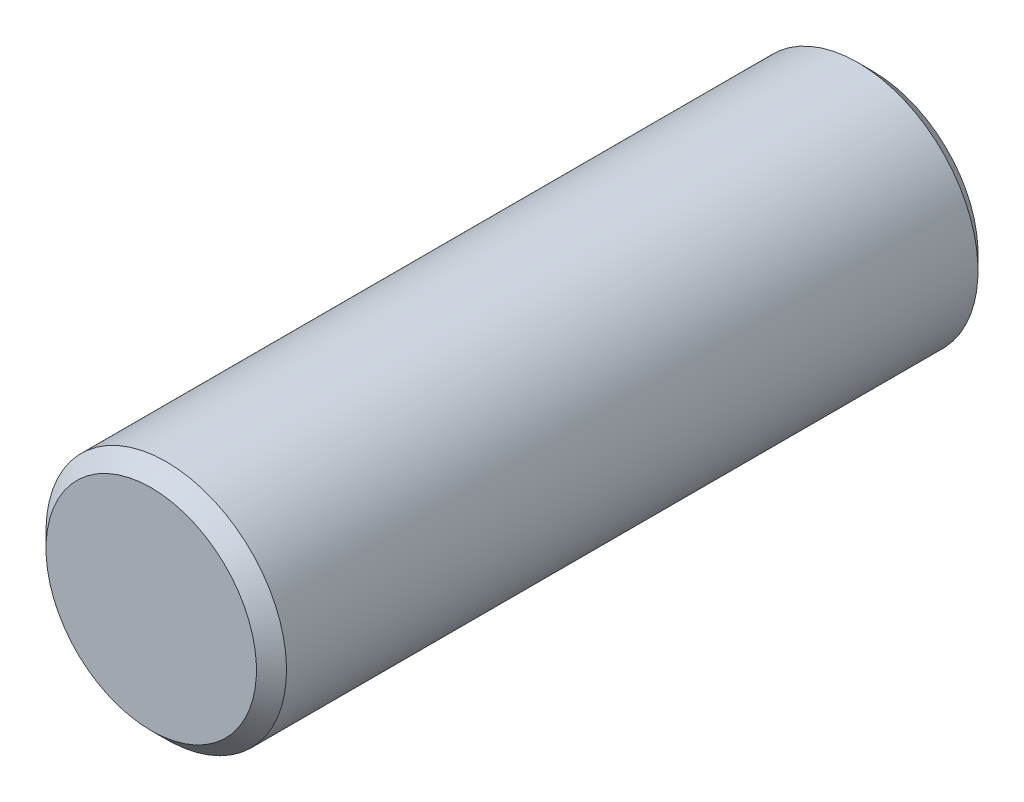
ISO-10303-21;
HEADER;
FILE_DESCRIPTION(('STEP AP214'),'2;1');
FILE_NAME('part.step','',(''),(''),'','','');
FILE_SCHEMA(('AUTOMOTIVE_DESIGN { 1 0 10303 214 1 1 1 1 }'));
ENDSEC;
DATA;
#1=APPLICATION_CONTEXT('core data for automotive mechanical design processes');
#2=APPLICATION_PROTOCOL_DEFINITION('international standard','automotive_design',2000,#1);
#3=PRODUCT_CONTEXT('',#1,'mechanical');
#4=PRODUCT('Part','Part','',(#3));
#5=PRODUCT_RELATED_PRODUCT_CATEGORY('part','',(#4));
#6=PRODUCT_DEFINITION_FORMATION('','',#4);
#7=PRODUCT_DEFINITION_CONTEXT('part definition',#1,'design');
#8=PRODUCT_DEFINITION('design','',#6,#7);
#9=PRODUCT_DEFINITION_SHAPE('','',#8);
#10=(LENGTH_UNIT() NAMED_UNIT(*) SI_UNIT(.MILLI.,.METRE.));
#11=(NAMED_UNIT(*) PLANE_ANGLE_UNIT() SI_UNIT($,.RADIAN.));
#12=(NAMED_UNIT(*) SI_UNIT($,.STERADIAN.) SOLID_ANGLE_UNIT());
#13=UNCERTAINTY_MEASURE_WITH_UNIT(LENGTH_MEASURE(1.E-05),#10,'distance_accuracy_value','');
#14=(GEOMETRIC_REPRESENTATION_CONTEXT(3) GLOBAL_UNCERTAINTY_ASSIGNED_CONTEXT((#13)) GLOBAL_UNIT_ASSIGNED_CONTEXT((#10,
#11,#12)) REPRESENTATION_CONTEXT('',''));
#15=CARTESIAN_POINT('',(0.,0.,0.));
#16=DIRECTION('',(0.,0.,1.));
#17=DIRECTION('',(1.,0.,0.));
#18=AXIS2_PLACEMENT_3D('',#15,#16,#17);
#19=CARTESIAN_POINT('',(0.,0.,5.99999999999999));
#20=DIRECTION('',(0.,0.,1.));
#21=DIRECTION('',(0.,-1.,0.));
#22=AXIS2_PLACEMENT_3D('',#19,#20,#21);
#23=PLANE('',#22);
#24=CARTESIAN_POINT('',(0.,0.,6.00000000002865));
#25=DIRECTION('',(0.,0.,-1.));
#26=DIRECTION('',(0.,1.,0.));
#27=AXIS2_PLACEMENT_3D('',#24,#25,#26);
#28=CIRCLE('',#27,1.74999999995861);
#29=CARTESIAN_POINT('',(0.,1.7499999999586,6.00000000002865));
#30=VERTEX_POINT('',#29);
#31=EDGE_CURVE('E18',#30,#30,#28,.T.);
#32=ORIENTED_EDGE('',*,*,#31,.F.);
#33=EDGE_LOOP('',(#32));
#34=FACE_BOUND('',#33,.T.);
#35=ADVANCED_FACE('F15',(#34),#23,.T.);
#36=CARTESIAN_POINT('',(0.,0.,-5.99999999999998));
#37=DIRECTION('',(0.,0.,1.));
#38=DIRECTION('',(0.,-1.,0.));
#39=AXIS2_PLACEMENT_3D('',#36,#37,#38);
#40=PLANE('',#39);
#41=CARTESIAN_POINT('',(0.,0.,-6.00000000002865));
#42=DIRECTION('',(0.,0.,1.));
#43=DIRECTION('',(0.,-1.,0.));
#44=AXIS2_PLACEMENT_3D('',#41,#42,#43);
#45=CIRCLE('',#44,1.75000000001546);
#46=CARTESIAN_POINT('',(0.,-1.75000000001548,-6.00000000002865));
#47=VERTEX_POINT('',#46);
#48=EDGE_CURVE('E30',#47,#47,#45,.T.);
#49=ORIENTED_EDGE('',*,*,#48,.F.);
#50=EDGE_LOOP('',(#49));
#51=FACE_BOUND('',#50,.T.);
#52=ADVANCED_FACE('F41',(#51),#40,.F.);
#53=CARTESIAN_POINT('',(0.,0.,5.7500000000914));
#54=DIRECTION('',(0.,0.,-1.));
#55=DIRECTION('',(0.,1.,0.));
#56=AXIS2_PLACEMENT_3D('',#53,#54,#55);
#57=CONICAL_SURFACE('',#56,1.99999999989586,0.785398163397448);
#58=CARTESIAN_POINT('',(0.,0.,5.74999999999999));
#59=DIRECTION('',(0.,0.,-1.));
#60=DIRECTION('',(0.,1.,0.));
#61=AXIS2_PLACEMENT_3D('',#58,#59,#60);
#62=CIRCLE('',#61,2.00000000000002);
#63=CARTESIAN_POINT('',(0.,2.,5.74999999999999));
#64=VERTEX_POINT('',#63);
#65=EDGE_CURVE('E23',#64,#64,#62,.T.);
#66=ORIENTED_EDGE('',*,*,#65,.F.);
#67=EDGE_LOOP('',(#66));
#68=FACE_BOUND('',#67,.T.);
#69=ORIENTED_EDGE('',*,*,#31,.T.);
#70=EDGE_LOOP('',(#69));
#71=FACE_BOUND('',#70,.T.);
#72=ADVANCED_FACE('F38',(#68,#71),#57,.T.);
#73=CARTESIAN_POINT('',(0.,0.,-5.7500000000914));
#74=DIRECTION('',(0.,0.,1.));
#75=DIRECTION('',(0.,-1.,0.));
#76=AXIS2_PLACEMENT_3D('',#73,#74,#75);
#77=CONICAL_SURFACE('',#76,1.99999999989586,0.785398163283761);
#78=CARTESIAN_POINT('',(0.,0.,-5.74999999999998));
#79=DIRECTION('',(0.,0.,-1.));
#80=DIRECTION('',(0.,1.,0.));
#81=AXIS2_PLACEMENT_3D('',#78,#79,#80);
#82=CIRCLE('',#81,2.00000000000002);
#83=CARTESIAN_POINT('',(0.,2.,-5.74999999999998));
#84=VERTEX_POINT('',#83);
#85=EDGE_CURVE('E10',#84,#84,#82,.F.);
#86=ORIENTED_EDGE('',*,*,#85,.F.);
#87=EDGE_LOOP('',(#86));
#88=FACE_BOUND('',#87,.T.);
#89=ORIENTED_EDGE('',*,*,#48,.T.);
#90=EDGE_LOOP('',(#89));
#91=FACE_BOUND('',#90,.T.);
#92=ADVANCED_FACE('F49',(#88,#91),#77,.T.);
#93=CARTESIAN_POINT('',(0.,0.,5.99999999999999));
#94=DIRECTION('',(0.,0.,-1.));
#95=DIRECTION('',(0.,1.,0.));
#96=AXIS2_PLACEMENT_3D('',#93,#94,#95);
#97=CYLINDRICAL_SURFACE('',#96,2.00000000000002);
#98=ORIENTED_EDGE('',*,*,#85,.T.);
#99=EDGE_LOOP('',(#98));
#100=FACE_BOUND('',#99,.T.);
#101=ORIENTED_EDGE('',*,*,#65,.T.);
#102=EDGE_LOOP('',(#101));
#103=FACE_BOUND('',#102,.T.);
#104=ADVANCED_FACE('F47',(#100,#103),#97,.T.);
#105=CLOSED_SHELL('',(#35,#52,#72,#92,#104));
#106=MANIFOLD_SOLID_BREP('B1',#105);
#107=ADVANCED_BREP_SHAPE_REPRESENTATION('',(#18,#106),#14);
#108=SHAPE_DEFINITION_REPRESENTATION(#9,#107);
ENDSEC;
END-ISO-10303-21;
